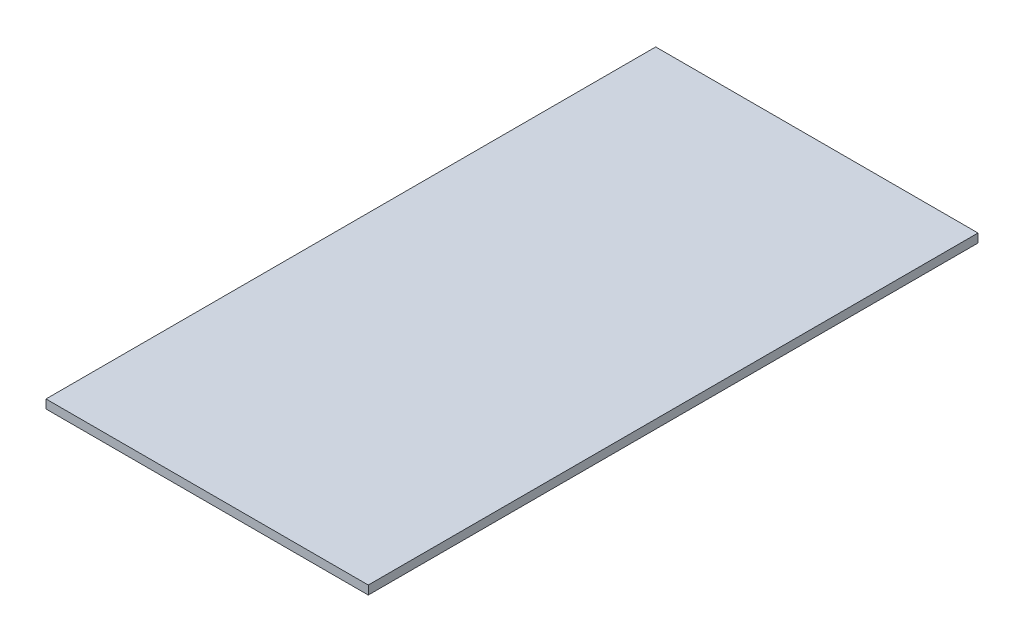
ISO-10303-21;
HEADER;
FILE_DESCRIPTION(('STEP AP214'),'2;1');
FILE_NAME('part.step','',(''),(''),'','','');
FILE_SCHEMA(('AUTOMOTIVE_DESIGN { 1 0 10303 214 1 1 1 1 }'));
ENDSEC;
DATA;
#1=APPLICATION_CONTEXT('core data for automotive mechanical design processes');
#2=APPLICATION_PROTOCOL_DEFINITION('international standard','automotive_design',2000,#1);
#3=PRODUCT_CONTEXT('',#1,'mechanical');
#4=PRODUCT('Part','Part','',(#3));
#5=PRODUCT_RELATED_PRODUCT_CATEGORY('part','',(#4));
#6=PRODUCT_DEFINITION_FORMATION('','',#4);
#7=PRODUCT_DEFINITION_CONTEXT('part definition',#1,'design');
#8=PRODUCT_DEFINITION('design','',#6,#7);
#9=PRODUCT_DEFINITION_SHAPE('','',#8);
#10=(LENGTH_UNIT() NAMED_UNIT(*) SI_UNIT(.MILLI.,.METRE.));
#11=(NAMED_UNIT(*) PLANE_ANGLE_UNIT() SI_UNIT($,.RADIAN.));
#12=(NAMED_UNIT(*) SI_UNIT($,.STERADIAN.) SOLID_ANGLE_UNIT());
#13=UNCERTAINTY_MEASURE_WITH_UNIT(LENGTH_MEASURE(1.E-05),#10,'distance_accuracy_value','');
#14=(GEOMETRIC_REPRESENTATION_CONTEXT(3) GLOBAL_UNCERTAINTY_ASSIGNED_CONTEXT((#13)) GLOBAL_UNIT_ASSIGNED_CONTEXT((#10,
#11,#12)) REPRESENTATION_CONTEXT('',''));
#15=CARTESIAN_POINT('',(0.,0.,0.));
#16=DIRECTION('',(0.,0.,1.));
#17=DIRECTION('',(1.,0.,0.));
#18=AXIS2_PLACEMENT_3D('',#15,#16,#17);
#19=CARTESIAN_POINT('',(469.9,25.4,889.));
#20=DIRECTION('',(-1.,0.,0.));
#21=DIRECTION('',(0.,0.,1.));
#22=AXIS2_PLACEMENT_3D('',#19,#20,#21);
#23=PLANE('',#22);
#24=DIRECTION('',(0.,0.,-1.));
#25=VECTOR('',#24,1.);
#26=CARTESIAN_POINT('',(469.9,0.,889.));
#27=LINE('',#26,#25);
#28=CARTESIAN_POINT('',(469.9,0.,889.));
#29=VERTEX_POINT('',#28);
#30=CARTESIAN_POINT('',(469.9,0.,-889.));
#31=VERTEX_POINT('',#30);
#32=EDGE_CURVE('E97',#29,#31,#27,.T.);
#33=ORIENTED_EDGE('',*,*,#32,.T.);
#34=DIRECTION('',(0.,-1.,0.));
#35=VECTOR('',#34,1.);
#36=CARTESIAN_POINT('',(469.9,25.4,-889.));
#37=LINE('',#36,#35);
#38=CARTESIAN_POINT('',(469.9,25.4,-889.));
#39=VERTEX_POINT('',#38);
#40=EDGE_CURVE('E11',#39,#31,#37,.T.);
#41=ORIENTED_EDGE('',*,*,#40,.F.);
#42=DIRECTION('',(0.,0.,-1.));
#43=VECTOR('',#42,1.);
#44=CARTESIAN_POINT('',(469.9,25.4,889.));
#45=LINE('',#44,#43);
#46=CARTESIAN_POINT('',(469.9,25.4,889.));
#47=VERTEX_POINT('',#46);
#48=EDGE_CURVE('E85',#47,#39,#45,.T.);
#49=ORIENTED_EDGE('',*,*,#48,.F.);
#50=DIRECTION('',(0.,-1.,0.));
#51=VECTOR('',#50,1.);
#52=CARTESIAN_POINT('',(469.9,25.4,889.));
#53=LINE('',#52,#51);
#54=EDGE_CURVE('E93',#47,#29,#53,.T.);
#55=ORIENTED_EDGE('',*,*,#54,.T.);
#56=EDGE_LOOP('',(#33,#41,#49,#55));
#57=FACE_BOUND('',#56,.T.);
#58=ADVANCED_FACE('F34',(#57),#23,.F.);
#59=CARTESIAN_POINT('',(-469.9,25.4,-889.));
#60=DIRECTION('',(0.,0.,1.));
#61=DIRECTION('',(1.,0.,0.));
#62=AXIS2_PLACEMENT_3D('',#59,#60,#61);
#63=PLANE('',#62);
#64=DIRECTION('',(-1.,0.,0.));
#65=VECTOR('',#64,1.);
#66=CARTESIAN_POINT('',(-469.9,0.,-889.));
#67=LINE('',#66,#65);
#68=CARTESIAN_POINT('',(-469.9,0.,-889.));
#69=VERTEX_POINT('',#68);
#70=EDGE_CURVE('E89',#31,#69,#67,.T.);
#71=ORIENTED_EDGE('',*,*,#70,.T.);
#72=DIRECTION('',(0.,-1.,0.));
#73=VECTOR('',#72,1.);
#74=CARTESIAN_POINT('',(-469.9,25.4,-889.));
#75=LINE('',#74,#73);
#76=CARTESIAN_POINT('',(-469.9,25.4,-889.));
#77=VERTEX_POINT('',#76);
#78=EDGE_CURVE('E42',#77,#69,#75,.T.);
#79=ORIENTED_EDGE('',*,*,#78,.F.);
#80=DIRECTION('',(-1.,0.,0.));
#81=VECTOR('',#80,1.);
#82=CARTESIAN_POINT('',(-469.9,25.4,-889.));
#83=LINE('',#82,#81);
#84=EDGE_CURVE('E80',#39,#77,#83,.T.);
#85=ORIENTED_EDGE('',*,*,#84,.F.);
#86=ORIENTED_EDGE('',*,*,#40,.T.);
#87=EDGE_LOOP('',(#71,#79,#85,#86));
#88=FACE_BOUND('',#87,.T.);
#89=ADVANCED_FACE('F88',(#88),#63,.F.);
#90=CARTESIAN_POINT('',(-469.9,25.4,889.));
#91=DIRECTION('',(1.,0.,0.));
#92=DIRECTION('',(0.,0.,-1.));
#93=AXIS2_PLACEMENT_3D('',#90,#91,#92);
#94=PLANE('',#93);
#95=DIRECTION('',(0.,0.,1.));
#96=VECTOR('',#95,1.);
#97=CARTESIAN_POINT('',(-469.9,0.,889.));
#98=LINE('',#97,#96);
#99=CARTESIAN_POINT('',(-469.9,0.,889.));
#100=VERTEX_POINT('',#99);
#101=EDGE_CURVE('E67',#69,#100,#98,.T.);
#102=ORIENTED_EDGE('',*,*,#101,.T.);
#103=DIRECTION('',(0.,-1.,0.));
#104=VECTOR('',#103,1.);
#105=CARTESIAN_POINT('',(-469.9,25.4,889.));
#106=LINE('',#105,#104);
#107=CARTESIAN_POINT('',(-469.9,25.4,889.));
#108=VERTEX_POINT('',#107);
#109=EDGE_CURVE('E90',#108,#100,#106,.T.);
#110=ORIENTED_EDGE('',*,*,#109,.F.);
#111=DIRECTION('',(0.,0.,1.));
#112=VECTOR('',#111,1.);
#113=CARTESIAN_POINT('',(-469.9,25.4,889.));
#114=LINE('',#113,#112);
#115=EDGE_CURVE('E83',#77,#108,#114,.T.);
#116=ORIENTED_EDGE('',*,*,#115,.F.);
#117=ORIENTED_EDGE('',*,*,#78,.T.);
#118=EDGE_LOOP('',(#102,#110,#116,#117));
#119=FACE_BOUND('',#118,.T.);
#120=ADVANCED_FACE('F91',(#119),#94,.F.);
#121=CARTESIAN_POINT('',(-469.9,25.4,889.));
#122=DIRECTION('',(0.,0.,-1.));
#123=DIRECTION('',(-1.,0.,0.));
#124=AXIS2_PLACEMENT_3D('',#121,#122,#123);
#125=PLANE('',#124);
#126=DIRECTION('',(1.,0.,0.));
#127=VECTOR('',#126,1.);
#128=CARTESIAN_POINT('',(-469.9,0.,889.));
#129=LINE('',#128,#127);
#130=EDGE_CURVE('E73',#100,#29,#129,.T.);
#131=ORIENTED_EDGE('',*,*,#130,.T.);
#132=ORIENTED_EDGE('',*,*,#54,.F.);
#133=DIRECTION('',(1.,0.,0.));
#134=VECTOR('',#133,1.);
#135=CARTESIAN_POINT('',(-469.9,25.4,889.));
#136=LINE('',#135,#134);
#137=EDGE_CURVE('E50',#108,#47,#136,.T.);
#138=ORIENTED_EDGE('',*,*,#137,.F.);
#139=ORIENTED_EDGE('',*,*,#109,.T.);
#140=EDGE_LOOP('',(#131,#132,#138,#139));
#141=FACE_BOUND('',#140,.T.);
#142=ADVANCED_FACE('F104',(#141),#125,.F.);
#143=CARTESIAN_POINT('',(0.,25.4,0.));
#144=DIRECTION('',(0.,-1.,0.));
#145=DIRECTION('',(0.,0.,-1.));
#146=AXIS2_PLACEMENT_3D('',#143,#144,#145);
#147=PLANE('',#146);
#148=ORIENTED_EDGE('',*,*,#48,.T.);
#149=ORIENTED_EDGE('',*,*,#84,.T.);
#150=ORIENTED_EDGE('',*,*,#115,.T.);
#151=ORIENTED_EDGE('',*,*,#137,.T.);
#152=EDGE_LOOP('',(#148,#149,#150,#151));
#153=FACE_BOUND('',#152,.T.);
#154=ADVANCED_FACE('F81',(#153),#147,.F.);
#155=CARTESIAN_POINT('',(0.,0.,0.));
#156=DIRECTION('',(0.,-1.,0.));
#157=DIRECTION('',(0.,0.,-1.));
#158=AXIS2_PLACEMENT_3D('',#155,#156,#157);
#159=PLANE('',#158);
#160=ORIENTED_EDGE('',*,*,#32,.F.);
#161=ORIENTED_EDGE('',*,*,#130,.F.);
#162=ORIENTED_EDGE('',*,*,#101,.F.);
#163=ORIENTED_EDGE('',*,*,#70,.F.);
#164=EDGE_LOOP('',(#160,#161,#162,#163));
#165=FACE_BOUND('',#164,.T.);
#166=ADVANCED_FACE('F107',(#165),#159,.T.);
#167=CLOSED_SHELL('',(#58,#89,#120,#142,#154,#166));
#168=MANIFOLD_SOLID_BREP('B2',#167);
#169=ADVANCED_BREP_SHAPE_REPRESENTATION('',(#18,#168),#14);
#170=SHAPE_DEFINITION_REPRESENTATION(#9,#169);
ENDSEC;
END-ISO-10303-21;
